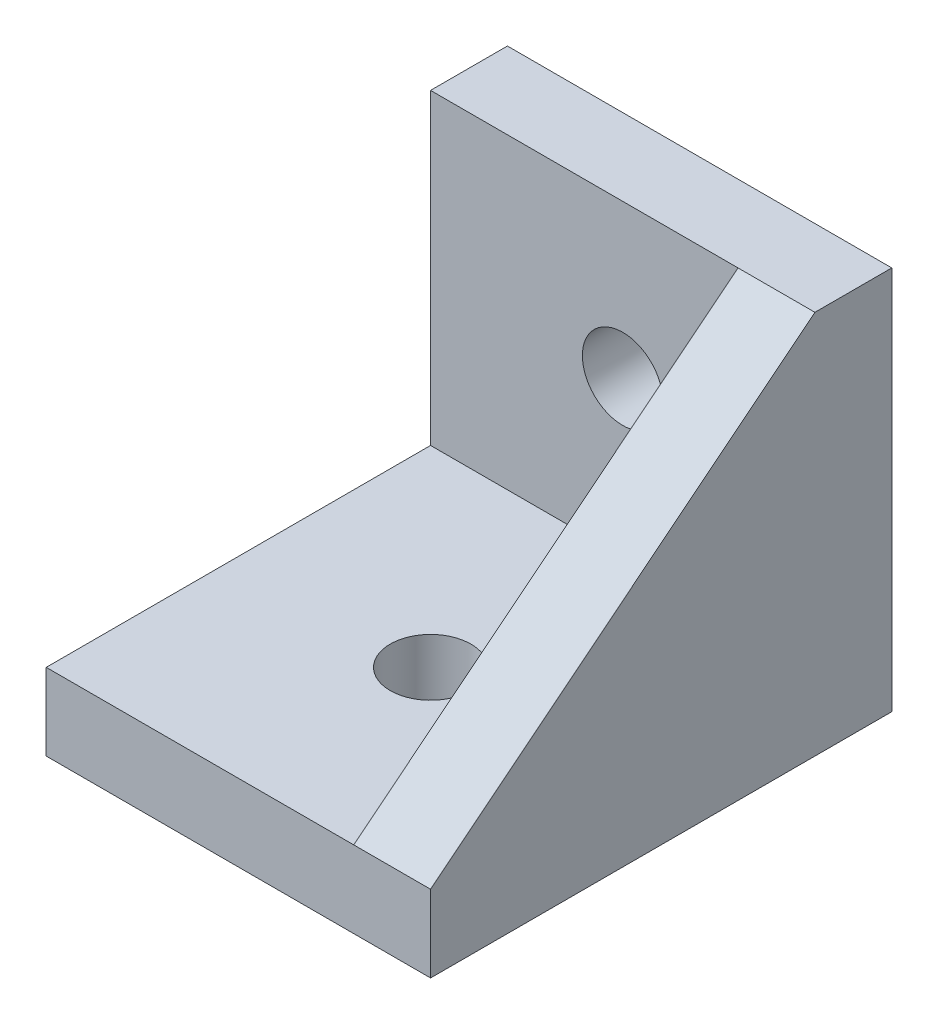
ISO-10303-21;
HEADER;
FILE_DESCRIPTION(('STEP AP214'),'2;1');
FILE_NAME('part.step','',(''),(''),'','','');
FILE_SCHEMA(('AUTOMOTIVE_DESIGN { 1 0 10303 214 1 1 1 1 }'));
ENDSEC;
DATA;
#1=APPLICATION_CONTEXT('core data for automotive mechanical design processes');
#2=APPLICATION_PROTOCOL_DEFINITION('international standard','automotive_design',2000,#1);
#3=PRODUCT_CONTEXT('',#1,'mechanical');
#4=PRODUCT('Part','Part','',(#3));
#5=PRODUCT_RELATED_PRODUCT_CATEGORY('part','',(#4));
#6=PRODUCT_DEFINITION_FORMATION('','',#4);
#7=PRODUCT_DEFINITION_CONTEXT('part definition',#1,'design');
#8=PRODUCT_DEFINITION('design','',#6,#7);
#9=PRODUCT_DEFINITION_SHAPE('','',#8);
#10=(LENGTH_UNIT() NAMED_UNIT(*) SI_UNIT(.MILLI.,.METRE.));
#11=(NAMED_UNIT(*) PLANE_ANGLE_UNIT() SI_UNIT($,.RADIAN.));
#12=(NAMED_UNIT(*) SI_UNIT($,.STERADIAN.) SOLID_ANGLE_UNIT());
#13=UNCERTAINTY_MEASURE_WITH_UNIT(LENGTH_MEASURE(1.E-05),#10,'distance_accuracy_value','');
#14=(GEOMETRIC_REPRESENTATION_CONTEXT(3) GLOBAL_UNCERTAINTY_ASSIGNED_CONTEXT((#13)) GLOBAL_UNIT_ASSIGNED_CONTEXT((#10,
#11,#12)) REPRESENTATION_CONTEXT('',''));
#15=CARTESIAN_POINT('',(0.,0.,0.));
#16=DIRECTION('',(0.,0.,1.));
#17=DIRECTION('',(1.,0.,0.));
#18=AXIS2_PLACEMENT_3D('',#15,#16,#17);
#19=CARTESIAN_POINT('',(0.,0.,3.));
#20=DIRECTION('',(0.,0.,-1.));
#21=DIRECTION('',(-1.,0.,0.));
#22=AXIS2_PLACEMENT_3D('',#19,#20,#21);
#23=PLANE('',#22);
#24=CARTESIAN_POINT('',(1.5,1.5,3.));
#25=DIRECTION('',(0.,0.,1.));
#26=DIRECTION('',(1.,0.,0.));
#27=AXIS2_PLACEMENT_3D('',#24,#25,#26);
#28=CIRCLE('',#27,1.575);
#29=CARTESIAN_POINT('',(3.075,1.5,3.));
#30=VERTEX_POINT('',#29);
#31=EDGE_CURVE('E128',#30,#30,#28,.T.);
#32=ORIENTED_EDGE('',*,*,#31,.F.);
#33=EDGE_LOOP('',(#32));
#34=FACE_BOUND('',#33,.T.);
#35=DIRECTION('',(-1.,0.,0.));
#36=VECTOR('',#35,1.);
#37=CARTESIAN_POINT('',(-6.000619952,-4.50062,3.));
#38=LINE('',#37,#36);
#39=CARTESIAN_POINT('',(6.000619952,-4.50062,3.));
#40=VERTEX_POINT('',#39);
#41=CARTESIAN_POINT('',(-6.000619952,-4.50062,3.));
#42=VERTEX_POINT('',#41);
#43=EDGE_CURVE('E142',#40,#42,#38,.T.);
#44=ORIENTED_EDGE('',*,*,#43,.F.);
#45=DIRECTION('',(0.,1.,0.));
#46=VECTOR('',#45,1.);
#47=CARTESIAN_POINT('',(6.000619952,-7.50062,3.));
#48=LINE('',#47,#46);
#49=CARTESIAN_POINT('',(6.000619952,7.50062,3.));
#50=VERTEX_POINT('',#49);
#51=EDGE_CURVE('E50',#40,#50,#48,.T.);
#52=ORIENTED_EDGE('',*,*,#51,.T.);
#53=DIRECTION('',(-1.,0.,0.));
#54=VECTOR('',#53,1.);
#55=CARTESIAN_POINT('',(-6.000619952,7.50062,3.));
#56=LINE('',#55,#54);
#57=CARTESIAN_POINT('',(-6.000619952,7.50062,3.));
#58=VERTEX_POINT('',#57);
#59=EDGE_CURVE('E58',#50,#58,#56,.T.);
#60=ORIENTED_EDGE('',*,*,#59,.T.);
#61=DIRECTION('',(0.,-1.,0.));
#62=VECTOR('',#61,1.);
#63=CARTESIAN_POINT('',(-6.000619952,-7.50062,3.));
#64=LINE('',#63,#62);
#65=EDGE_CURVE('E157',#58,#42,#64,.T.);
#66=ORIENTED_EDGE('',*,*,#65,.T.);
#67=EDGE_LOOP('',(#44,#52,#60,#66));
#68=FACE_BOUND('',#67,.T.);
#69=ADVANCED_FACE('F33',(#34,#68),#23,.F.);
#70=CARTESIAN_POINT('',(-6.000619952,7.50062,3.));
#71=DIRECTION('',(0.,-1.,0.));
#72=DIRECTION('',(0.,0.,-1.));
#73=AXIS2_PLACEMENT_3D('',#70,#71,#72);
#74=PLANE('',#73);
#75=DIRECTION('',(-1.,0.,0.));
#76=VECTOR('',#75,1.);
#77=CARTESIAN_POINT('',(-6.000619952,7.50062,0.));
#78=LINE('',#77,#76);
#79=CARTESIAN_POINT('',(9.000619952,7.50062,0.));
#80=VERTEX_POINT('',#79);
#81=CARTESIAN_POINT('',(-6.000619952,7.50062,0.));
#82=VERTEX_POINT('',#81);
#83=EDGE_CURVE('E71',#80,#82,#78,.T.);
#84=ORIENTED_EDGE('',*,*,#83,.T.);
#85=DIRECTION('',(0.,0.,-1.));
#86=VECTOR('',#85,1.);
#87=CARTESIAN_POINT('',(-6.000619952,7.50062,3.));
#88=LINE('',#87,#86);
#89=EDGE_CURVE('E11',#58,#82,#88,.T.);
#90=ORIENTED_EDGE('',*,*,#89,.F.);
#91=ORIENTED_EDGE('',*,*,#59,.F.);
#92=DIRECTION('',(-1.,0.,0.));
#93=VECTOR('',#92,1.);
#94=CARTESIAN_POINT('',(9.000619952,7.50062,3.));
#95=LINE('',#94,#93);
#96=CARTESIAN_POINT('',(9.000619952,7.50062,3.));
#97=VERTEX_POINT('',#96);
#98=EDGE_CURVE('E140',#97,#50,#95,.T.);
#99=ORIENTED_EDGE('',*,*,#98,.F.);
#100=DIRECTION('',(0.,0.,1.));
#101=VECTOR('',#100,1.);
#102=CARTESIAN_POINT('',(9.000619952,7.50062,3.));
#103=LINE('',#102,#101);
#104=EDGE_CURVE('E119',#80,#97,#103,.T.);
#105=ORIENTED_EDGE('',*,*,#104,.F.);
#106=EDGE_LOOP('',(#84,#90,#91,#99,#105));
#107=FACE_BOUND('',#106,.T.);
#108=ADVANCED_FACE('F35',(#107),#74,.F.);
#109=CARTESIAN_POINT('',(-6.000619952,-7.50062,3.));
#110=DIRECTION('',(1.,0.,0.));
#111=DIRECTION('',(0.,0.,-1.));
#112=AXIS2_PLACEMENT_3D('',#109,#110,#111);
#113=PLANE('',#112);
#114=DIRECTION('',(0.,-1.,0.));
#115=VECTOR('',#114,1.);
#116=CARTESIAN_POINT('',(-6.000619952,-7.50062,0.));
#117=LINE('',#116,#115);
#118=CARTESIAN_POINT('',(-6.000619952,-7.50062,0.));
#119=VERTEX_POINT('',#118);
#120=EDGE_CURVE('E113',#82,#119,#117,.T.);
#121=ORIENTED_EDGE('',*,*,#120,.T.);
#122=DIRECTION('',(0.,0.,-1.));
#123=VECTOR('',#122,1.);
#124=CARTESIAN_POINT('',(-6.000619952,-7.50062,3.));
#125=LINE('',#124,#123);
#126=CARTESIAN_POINT('',(-6.000619952,-7.50062,18.));
#127=VERTEX_POINT('',#126);
#128=EDGE_CURVE('E42',#127,#119,#125,.T.);
#129=ORIENTED_EDGE('',*,*,#128,.F.);
#130=DIRECTION('',(0.,-1.,0.));
#131=VECTOR('',#130,1.);
#132=CARTESIAN_POINT('',(-6.000619952,-4.50062,18.));
#133=LINE('',#132,#131);
#134=CARTESIAN_POINT('',(-6.000619952,-4.50062,18.));
#135=VERTEX_POINT('',#134);
#136=EDGE_CURVE('E143',#135,#127,#133,.T.);
#137=ORIENTED_EDGE('',*,*,#136,.F.);
#138=DIRECTION('',(0.,0.,-1.));
#139=VECTOR('',#138,1.);
#140=CARTESIAN_POINT('',(-6.000619952,-4.50062,18.));
#141=LINE('',#140,#139);
#142=EDGE_CURVE('E148',#135,#42,#141,.T.);
#143=ORIENTED_EDGE('',*,*,#142,.T.);
#144=ORIENTED_EDGE('',*,*,#65,.F.);
#145=ORIENTED_EDGE('',*,*,#89,.T.);
#146=EDGE_LOOP('',(#121,#129,#137,#143,#144,#145));
#147=FACE_BOUND('',#146,.T.);
#148=ADVANCED_FACE('F174',(#147),#113,.F.);
#149=CARTESIAN_POINT('',(-6.000619952,-7.50062,3.));
#150=DIRECTION('',(0.,1.,0.));
#151=DIRECTION('',(0.,0.,1.));
#152=AXIS2_PLACEMENT_3D('',#149,#150,#151);
#153=PLANE('',#152);
#154=CARTESIAN_POINT('',(1.5,-7.50062,10.5));
#155=DIRECTION('',(0.,1.,0.));
#156=DIRECTION('',(0.,0.,1.));
#157=AXIS2_PLACEMENT_3D('',#154,#155,#156);
#158=CIRCLE('',#157,1.575);
#159=CARTESIAN_POINT('',(1.5,-7.50062,12.075));
#160=VERTEX_POINT('',#159);
#161=EDGE_CURVE('E309',#160,#160,#158,.F.);
#162=ORIENTED_EDGE('',*,*,#161,.F.);
#163=EDGE_LOOP('',(#162));
#164=FACE_BOUND('',#163,.T.);
#165=DIRECTION('',(1.,0.,0.));
#166=VECTOR('',#165,1.);
#167=CARTESIAN_POINT('',(-6.000619952,-7.50062,0.));
#168=LINE('',#167,#166);
#169=CARTESIAN_POINT('',(9.000619952,-7.50062,0.));
#170=VERTEX_POINT('',#169);
#171=EDGE_CURVE('E105',#119,#170,#168,.T.);
#172=ORIENTED_EDGE('',*,*,#171,.T.);
#173=DIRECTION('',(0.,0.,-1.));
#174=VECTOR('',#173,1.);
#175=CARTESIAN_POINT('',(9.000619952,-7.50062,18.));
#176=LINE('',#175,#174);
#177=CARTESIAN_POINT('',(9.000619952,-7.50062,18.));
#178=VERTEX_POINT('',#177);
#179=EDGE_CURVE('E110',#178,#170,#176,.T.);
#180=ORIENTED_EDGE('',*,*,#179,.F.);
#181=DIRECTION('',(1.,0.,0.));
#182=VECTOR('',#181,1.);
#183=CARTESIAN_POINT('',(-6.000619952,-7.50062,18.));
#184=LINE('',#183,#182);
#185=EDGE_CURVE('E145',#127,#178,#184,.T.);
#186=ORIENTED_EDGE('',*,*,#185,.F.);
#187=ORIENTED_EDGE('',*,*,#128,.T.);
#188=EDGE_LOOP('',(#172,#180,#186,#187));
#189=FACE_BOUND('',#188,.T.);
#190=ADVANCED_FACE('F107',(#164,#189),#153,.F.);
#191=CARTESIAN_POINT('',(0.,0.,0.));
#192=DIRECTION('',(0.,0.,-1.));
#193=DIRECTION('',(-1.,0.,0.));
#194=AXIS2_PLACEMENT_3D('',#191,#192,#193);
#195=PLANE('',#194);
#196=CARTESIAN_POINT('',(1.5,1.5,0.));
#197=DIRECTION('',(0.,0.,-1.));
#198=DIRECTION('',(-1.,0.,0.));
#199=AXIS2_PLACEMENT_3D('',#196,#197,#198);
#200=CIRCLE('',#199,1.575);
#201=CARTESIAN_POINT('',(-0.0750000000000008,1.5,0.));
#202=VERTEX_POINT('',#201);
#203=EDGE_CURVE('E131',#202,#202,#200,.F.);
#204=ORIENTED_EDGE('',*,*,#203,.T.);
#205=EDGE_LOOP('',(#204));
#206=FACE_BOUND('',#205,.T.);
#207=ORIENTED_EDGE('',*,*,#83,.F.);
#208=DIRECTION('',(0.,1.,0.));
#209=VECTOR('',#208,1.);
#210=CARTESIAN_POINT('',(9.000619952,-7.50062,0.));
#211=LINE('',#210,#209);
#212=EDGE_CURVE('E116',#170,#80,#211,.T.);
#213=ORIENTED_EDGE('',*,*,#212,.F.);
#214=ORIENTED_EDGE('',*,*,#171,.F.);
#215=ORIENTED_EDGE('',*,*,#120,.F.);
#216=EDGE_LOOP('',(#207,#213,#214,#215));
#217=FACE_BOUND('',#216,.T.);
#218=ADVANCED_FACE('F117',(#206,#217),#195,.T.);
#219=CARTESIAN_POINT('',(-6.000619952,-4.50062,18.));
#220=DIRECTION('',(0.,-1.,0.));
#221=DIRECTION('',(1.,0.,0.));
#222=AXIS2_PLACEMENT_3D('',#219,#220,#221);
#223=PLANE('',#222);
#224=CARTESIAN_POINT('',(1.5,-4.50062,10.5));
#225=DIRECTION('',(0.,1.,0.));
#226=DIRECTION('',(0.,0.,1.));
#227=AXIS2_PLACEMENT_3D('',#224,#225,#226);
#228=CIRCLE('',#227,1.575);
#229=CARTESIAN_POINT('',(1.5,-4.50062,12.075));
#230=VERTEX_POINT('',#229);
#231=EDGE_CURVE('E306',#230,#230,#228,.T.);
#232=ORIENTED_EDGE('',*,*,#231,.F.);
#233=EDGE_LOOP('',(#232));
#234=FACE_BOUND('',#233,.T.);
#235=ORIENTED_EDGE('',*,*,#43,.T.);
#236=ORIENTED_EDGE('',*,*,#142,.F.);
#237=DIRECTION('',(-1.,0.,0.));
#238=VECTOR('',#237,1.);
#239=CARTESIAN_POINT('',(-6.000619952,-4.50062,18.));
#240=LINE('',#239,#238);
#241=CARTESIAN_POINT('',(6.000619952,-4.50062,18.));
#242=VERTEX_POINT('',#241);
#243=EDGE_CURVE('E78',#242,#135,#240,.T.);
#244=ORIENTED_EDGE('',*,*,#243,.F.);
#245=DIRECTION('',(0.,0.,-1.));
#246=VECTOR('',#245,1.);
#247=CARTESIAN_POINT('',(6.000619952,-4.50062,18.));
#248=LINE('',#247,#246);
#249=EDGE_CURVE('E162',#242,#40,#248,.T.);
#250=ORIENTED_EDGE('',*,*,#249,.T.);
#251=EDGE_LOOP('',(#235,#236,#244,#250));
#252=FACE_BOUND('',#251,.T.);
#253=ADVANCED_FACE('F172',(#234,#252),#223,.F.);
#254=CARTESIAN_POINT('',(0.,0.,18.));
#255=DIRECTION('',(0.,0.,1.));
#256=DIRECTION('',(1.,0.,0.));
#257=AXIS2_PLACEMENT_3D('',#254,#255,#256);
#258=PLANE('',#257);
#259=ORIENTED_EDGE('',*,*,#136,.T.);
#260=ORIENTED_EDGE('',*,*,#185,.T.);
#261=DIRECTION('',(0.,-1.,0.));
#262=VECTOR('',#261,1.);
#263=CARTESIAN_POINT('',(9.000619952,-7.50062,18.));
#264=LINE('',#263,#262);
#265=CARTESIAN_POINT('',(9.000619952,-4.50062,18.));
#266=VERTEX_POINT('',#265);
#267=EDGE_CURVE('E124',#266,#178,#264,.T.);
#268=ORIENTED_EDGE('',*,*,#267,.F.);
#269=DIRECTION('',(-1.,0.,0.));
#270=VECTOR('',#269,1.);
#271=CARTESIAN_POINT('',(9.000619952,-4.50062,18.));
#272=LINE('',#271,#270);
#273=EDGE_CURVE('E137',#266,#242,#272,.T.);
#274=ORIENTED_EDGE('',*,*,#273,.T.);
#275=ORIENTED_EDGE('',*,*,#243,.T.);
#276=EDGE_LOOP('',(#259,#260,#268,#274,#275));
#277=FACE_BOUND('',#276,.T.);
#278=ADVANCED_FACE('F175',(#277),#258,.T.);
#279=CARTESIAN_POINT('',(9.000619952,-4.50062,18.));
#280=DIRECTION('',(0.,-0.780837321027411,-0.624734406040467));
#281=DIRECTION('',(0.,0.624734406040467,-0.780837321027411));
#282=AXIS2_PLACEMENT_3D('',#279,#280,#281);
#283=PLANE('',#282);
#284=DIRECTION('',(0.,-0.624734406040467,0.780837321027411));
#285=VECTOR('',#284,1.);
#286=CARTESIAN_POINT('',(6.000619952,-4.50062,18.));
#287=LINE('',#286,#285);
#288=EDGE_CURVE('E125',#50,#242,#287,.T.);
#289=ORIENTED_EDGE('',*,*,#288,.T.);
#290=ORIENTED_EDGE('',*,*,#273,.F.);
#291=DIRECTION('',(0.,-0.624734406040467,0.780837321027411));
#292=VECTOR('',#291,1.);
#293=CARTESIAN_POINT('',(9.000619952,-4.50062,18.));
#294=LINE('',#293,#292);
#295=EDGE_CURVE('E135',#97,#266,#294,.T.);
#296=ORIENTED_EDGE('',*,*,#295,.F.);
#297=ORIENTED_EDGE('',*,*,#98,.T.);
#298=EDGE_LOOP('',(#289,#290,#296,#297));
#299=FACE_BOUND('',#298,.T.);
#300=ADVANCED_FACE('F179',(#299),#283,.F.);
#301=CARTESIAN_POINT('',(9.000619952,0.,0.));
#302=DIRECTION('',(1.,0.,0.));
#303=DIRECTION('',(0.,0.,-1.));
#304=AXIS2_PLACEMENT_3D('',#301,#302,#303);
#305=PLANE('',#304);
#306=ORIENTED_EDGE('',*,*,#179,.T.);
#307=ORIENTED_EDGE('',*,*,#212,.T.);
#308=ORIENTED_EDGE('',*,*,#104,.T.);
#309=ORIENTED_EDGE('',*,*,#295,.T.);
#310=ORIENTED_EDGE('',*,*,#267,.T.);
#311=EDGE_LOOP('',(#306,#307,#308,#309,#310));
#312=FACE_BOUND('',#311,.T.);
#313=ADVANCED_FACE('F122',(#312),#305,.T.);
#314=CARTESIAN_POINT('',(6.000619952,0.,0.));
#315=DIRECTION('',(1.,0.,0.));
#316=DIRECTION('',(0.,0.,-1.));
#317=AXIS2_PLACEMENT_3D('',#314,#315,#316);
#318=PLANE('',#317);
#319=ORIENTED_EDGE('',*,*,#51,.F.);
#320=ORIENTED_EDGE('',*,*,#249,.F.);
#321=ORIENTED_EDGE('',*,*,#288,.F.);
#322=EDGE_LOOP('',(#319,#320,#321));
#323=FACE_BOUND('',#322,.T.);
#324=ADVANCED_FACE('F181',(#323),#318,.F.);
#325=CARTESIAN_POINT('',(1.5,1.5,-0.00100000000000013));
#326=DIRECTION('',(0.,0.,1.));
#327=DIRECTION('',(1.,0.,0.));
#328=AXIS2_PLACEMENT_3D('',#325,#326,#327);
#329=CYLINDRICAL_SURFACE('',#328,1.575);
#330=ORIENTED_EDGE('',*,*,#203,.F.);
#331=EDGE_LOOP('',(#330));
#332=FACE_BOUND('',#331,.T.);
#333=ORIENTED_EDGE('',*,*,#31,.T.);
#334=EDGE_LOOP('',(#333));
#335=FACE_BOUND('',#334,.T.);
#336=ADVANCED_FACE('F183',(#332,#335),#329,.F.);
#337=CARTESIAN_POINT('',(1.5,-7.50162,10.5));
#338=DIRECTION('',(0.,1.,0.));
#339=DIRECTION('',(0.,0.,1.));
#340=AXIS2_PLACEMENT_3D('',#337,#338,#339);
#341=CYLINDRICAL_SURFACE('',#340,1.575);
#342=ORIENTED_EDGE('',*,*,#231,.T.);
#343=EDGE_LOOP('',(#342));
#344=FACE_BOUND('',#343,.T.);
#345=ORIENTED_EDGE('',*,*,#161,.T.);
#346=EDGE_LOOP('',(#345));
#347=FACE_BOUND('',#346,.T.);
#348=ADVANCED_FACE('F189',(#344,#347),#341,.F.);
#349=CLOSED_SHELL('',(#69,#108,#148,#190,#218,#253,#278,#300,#313,#324,#336,#348));
#350=MANIFOLD_SOLID_BREP('B2',#349);
#351=ADVANCED_BREP_SHAPE_REPRESENTATION('',(#18,#350),#14);
#352=SHAPE_DEFINITION_REPRESENTATION(#9,#351);
ENDSEC;
END-ISO-10303-21;
